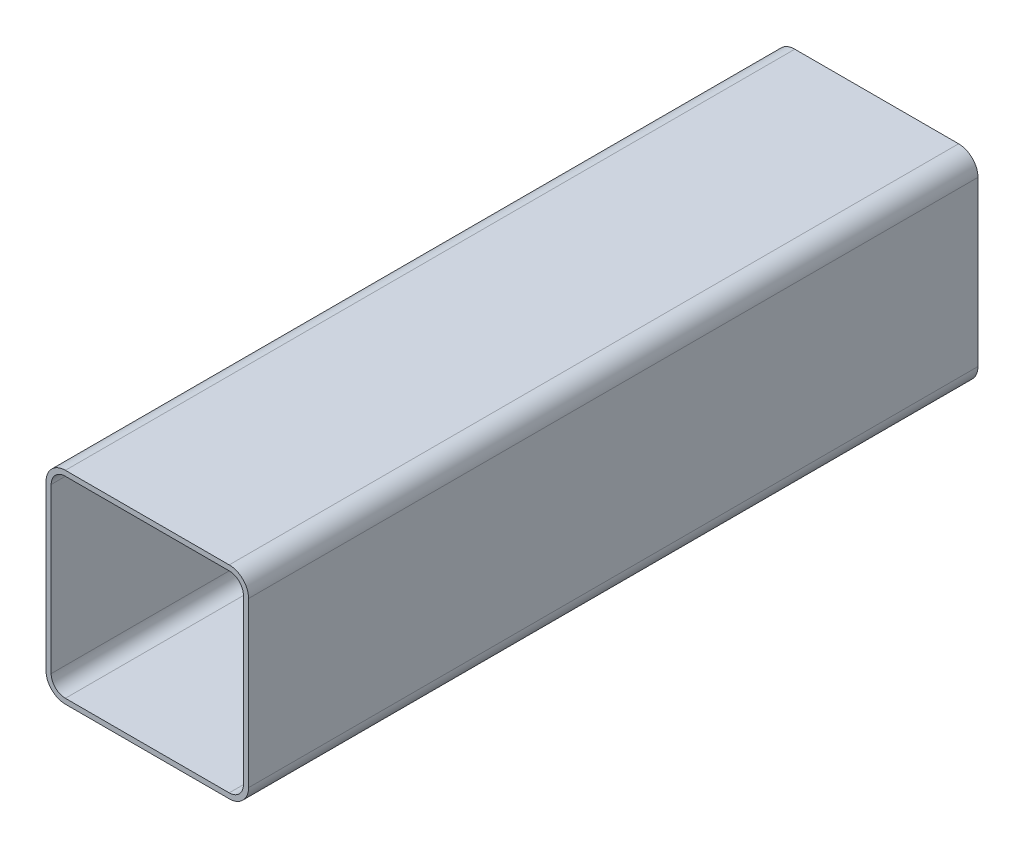
ISO-10303-21;
HEADER;
FILE_DESCRIPTION(('STEP AP214'),'2;1');
FILE_NAME('part.step','',(''),(''),'','','');
FILE_SCHEMA(('AUTOMOTIVE_DESIGN { 1 0 10303 214 1 1 1 1 }'));
ENDSEC;
DATA;
#1=APPLICATION_CONTEXT('core data for automotive mechanical design processes');
#2=APPLICATION_PROTOCOL_DEFINITION('international standard','automotive_design',2000,#1);
#3=PRODUCT_CONTEXT('',#1,'mechanical');
#4=PRODUCT('Part','Part','',(#3));
#5=PRODUCT_RELATED_PRODUCT_CATEGORY('part','',(#4));
#6=PRODUCT_DEFINITION_FORMATION('','',#4);
#7=PRODUCT_DEFINITION_CONTEXT('part definition',#1,'design');
#8=PRODUCT_DEFINITION('design','',#6,#7);
#9=PRODUCT_DEFINITION_SHAPE('','',#8);
#10=(LENGTH_UNIT() NAMED_UNIT(*) SI_UNIT(.MILLI.,.METRE.));
#11=(NAMED_UNIT(*) PLANE_ANGLE_UNIT() SI_UNIT($,.RADIAN.));
#12=(NAMED_UNIT(*) SI_UNIT($,.STERADIAN.) SOLID_ANGLE_UNIT());
#13=UNCERTAINTY_MEASURE_WITH_UNIT(LENGTH_MEASURE(1.E-05),#10,'distance_accuracy_value','');
#14=(GEOMETRIC_REPRESENTATION_CONTEXT(3) GLOBAL_UNCERTAINTY_ASSIGNED_CONTEXT((#13)) GLOBAL_UNIT_ASSIGNED_CONTEXT((#10,
#11,#12)) REPRESENTATION_CONTEXT('',''));
#15=CARTESIAN_POINT('',(0.,0.,0.));
#16=DIRECTION('',(0.,0.,1.));
#17=DIRECTION('',(1.,0.,0.));
#18=AXIS2_PLACEMENT_3D('',#15,#16,#17);
#19=CARTESIAN_POINT('',(-42.3291,-42.3291,-152.4));
#20=DIRECTION('',(0.,0.,1.));
#21=DIRECTION('',(1.,0.,0.));
#22=AXIS2_PLACEMENT_3D('',#19,#20,#21);
#23=PLANE('',#22);
#24=DIRECTION('',(0.,1.,0.));
#25=VECTOR('',#24,1.);
#26=CARTESIAN_POINT('',(-40.1701,0.,-152.4));
#27=LINE('',#26,#25);
#28=CARTESIAN_POINT('',(-40.1701,-34.2265000005341,-152.4));
#29=VERTEX_POINT('',#28);
#30=CARTESIAN_POINT('',(-40.1701,34.2264999999996,-152.4));
#31=VERTEX_POINT('',#30);
#32=EDGE_CURVE('E157',#29,#31,#27,.T.);
#33=ORIENTED_EDGE('',*,*,#32,.F.);
#34=CARTESIAN_POINT('',(-34.2265,-34.2265000000007,-152.4));
#35=DIRECTION('',(0.,0.,-1.));
#36=DIRECTION('',(0.,1.,0.));
#37=AXIS2_PLACEMENT_3D('',#34,#35,#36);
#38=CIRCLE('',#37,5.9436);
#39=CARTESIAN_POINT('',(-34.2264999988568,-40.1701,-152.4));
#40=VERTEX_POINT('',#39);
#41=EDGE_CURVE('E208',#40,#29,#38,.T.);
#42=ORIENTED_EDGE('',*,*,#41,.F.);
#43=DIRECTION('',(-1.,0.,0.));
#44=VECTOR('',#43,1.);
#45=CARTESIAN_POINT('',(0.,-40.1701,-152.4));
#46=LINE('',#45,#44);
#47=CARTESIAN_POINT('',(34.2265,-40.1701,-152.4));
#48=VERTEX_POINT('',#47);
#49=EDGE_CURVE('E153',#48,#40,#46,.T.);
#50=ORIENTED_EDGE('',*,*,#49,.F.);
#51=CARTESIAN_POINT('',(34.2265,-34.2265000000007,-152.4));
#52=DIRECTION('',(0.,0.,-1.));
#53=DIRECTION('',(0.,1.,0.));
#54=AXIS2_PLACEMENT_3D('',#51,#52,#53);
#55=CIRCLE('',#54,5.9436);
#56=CARTESIAN_POINT('',(40.1701,-34.2265000012194,-152.4));
#57=VERTEX_POINT('',#56);
#58=EDGE_CURVE('E212',#57,#48,#55,.T.);
#59=ORIENTED_EDGE('',*,*,#58,.F.);
#60=DIRECTION('',(0.,-1.,0.));
#61=VECTOR('',#60,1.);
#62=CARTESIAN_POINT('',(40.1701,0.,-152.4));
#63=LINE('',#62,#61);
#64=CARTESIAN_POINT('',(40.1701,34.2264999999996,-152.4));
#65=VERTEX_POINT('',#64);
#66=EDGE_CURVE('E162',#65,#57,#63,.T.);
#67=ORIENTED_EDGE('',*,*,#66,.F.);
#68=CARTESIAN_POINT('',(34.2265,34.2264999999993,-152.4));
#69=DIRECTION('',(0.,0.,-1.));
#70=DIRECTION('',(0.,1.,0.));
#71=AXIS2_PLACEMENT_3D('',#68,#69,#70);
#72=CIRCLE('',#71,5.9436);
#73=CARTESIAN_POINT('',(34.2265000006095,40.1701,-152.4));
#74=VERTEX_POINT('',#73);
#75=EDGE_CURVE('E215',#74,#65,#72,.T.);
#76=ORIENTED_EDGE('',*,*,#75,.F.);
#77=DIRECTION('',(1.,0.,0.));
#78=VECTOR('',#77,1.);
#79=CARTESIAN_POINT('',(0.,40.1701,-152.4));
#80=LINE('',#79,#78);
#81=CARTESIAN_POINT('',(-34.2265,40.1701,-152.4));
#82=VERTEX_POINT('',#81);
#83=EDGE_CURVE('E167',#82,#74,#80,.T.);
#84=ORIENTED_EDGE('',*,*,#83,.F.);
#85=CARTESIAN_POINT('',(-34.2265,34.2264999999993,-152.4));
#86=DIRECTION('',(0.,0.,-1.));
#87=DIRECTION('',(0.,1.,0.));
#88=AXIS2_PLACEMENT_3D('',#85,#86,#87);
#89=CIRCLE('',#88,5.9436);
#90=EDGE_CURVE('E160',#31,#82,#89,.T.);
#91=ORIENTED_EDGE('',*,*,#90,.F.);
#92=EDGE_LOOP('',(#33,#42,#50,#59,#67,#76,#84,#91));
#93=FACE_BOUND('',#92,.T.);
#94=DIRECTION('',(0.,-1.,0.));
#95=VECTOR('',#94,1.);
#96=CARTESIAN_POINT('',(42.3291,0.,-152.4));
#97=LINE('',#96,#95);
#98=CARTESIAN_POINT('',(42.3291,34.2264999999997,-152.4));
#99=VERTEX_POINT('',#98);
#100=CARTESIAN_POINT('',(42.3291,-34.2265000000003,-152.4));
#101=VERTEX_POINT('',#100);
#102=EDGE_CURVE('E161',#99,#101,#97,.T.);
#103=ORIENTED_EDGE('',*,*,#102,.T.);
#104=CARTESIAN_POINT('',(34.2265,-34.2265000000005,-152.4));
#105=DIRECTION('',(0.,0.,-1.));
#106=DIRECTION('',(0.,1.,0.));
#107=AXIS2_PLACEMENT_3D('',#104,#105,#106);
#108=CIRCLE('',#107,8.1026);
#109=CARTESIAN_POINT('',(34.2265000015585,-42.3291,-152.4));
#110=VERTEX_POINT('',#109);
#111=EDGE_CURVE('E220',#101,#110,#108,.T.);
#112=ORIENTED_EDGE('',*,*,#111,.T.);
#113=DIRECTION('',(-1.,0.,0.));
#114=VECTOR('',#113,1.);
#115=CARTESIAN_POINT('',(0.,-42.3291,-152.4));
#116=LINE('',#115,#114);
#117=CARTESIAN_POINT('',(-34.2265,-42.3291,-152.4));
#118=VERTEX_POINT('',#117);
#119=EDGE_CURVE('E173',#110,#118,#116,.T.);
#120=ORIENTED_EDGE('',*,*,#119,.T.);
#121=CARTESIAN_POINT('',(-34.2265,-34.2265000000005,-152.4));
#122=DIRECTION('',(0.,0.,-1.));
#123=DIRECTION('',(0.,1.,0.));
#124=AXIS2_PLACEMENT_3D('',#121,#122,#123);
#125=CIRCLE('',#124,8.10260000000001);
#126=CARTESIAN_POINT('',(-42.3291,-34.2265000007278,-152.4));
#127=VERTEX_POINT('',#126);
#128=EDGE_CURVE('E224',#118,#127,#125,.T.);
#129=ORIENTED_EDGE('',*,*,#128,.T.);
#130=DIRECTION('',(0.,1.,0.));
#131=VECTOR('',#130,1.);
#132=CARTESIAN_POINT('',(-42.3291,0.,-152.4));
#133=LINE('',#132,#131);
#134=CARTESIAN_POINT('',(-42.3291,34.2264999999997,-152.4));
#135=VERTEX_POINT('',#134);
#136=EDGE_CURVE('E178',#127,#135,#133,.T.);
#137=ORIENTED_EDGE('',*,*,#136,.T.);
#138=CARTESIAN_POINT('',(-34.2265,34.2264999999995,-152.4));
#139=DIRECTION('',(0.,0.,-1.));
#140=DIRECTION('',(0.,1.,0.));
#141=AXIS2_PLACEMENT_3D('',#138,#139,#140);
#142=CIRCLE('',#141,8.10260000000001);
#143=CARTESIAN_POINT('',(-34.2264999991691,42.3291,-152.4));
#144=VERTEX_POINT('',#143);
#145=EDGE_CURVE('E140',#135,#144,#142,.T.);
#146=ORIENTED_EDGE('',*,*,#145,.T.);
#147=DIRECTION('',(1.,0.,0.));
#148=VECTOR('',#147,1.);
#149=CARTESIAN_POINT('',(0.,42.3291,-152.4));
#150=LINE('',#149,#148);
#151=CARTESIAN_POINT('',(34.2265,42.3291,-152.4));
#152=VERTEX_POINT('',#151);
#153=EDGE_CURVE('E138',#144,#152,#150,.T.);
#154=ORIENTED_EDGE('',*,*,#153,.T.);
#155=CARTESIAN_POINT('',(34.2265,34.2264999999995,-152.4));
#156=DIRECTION('',(0.,0.,-1.));
#157=DIRECTION('',(0.,1.,0.));
#158=AXIS2_PLACEMENT_3D('',#155,#156,#157);
#159=CIRCLE('',#158,8.1026);
#160=EDGE_CURVE('E19',#152,#99,#159,.T.);
#161=ORIENTED_EDGE('',*,*,#160,.T.);
#162=EDGE_LOOP('',(#103,#112,#120,#129,#137,#146,#154,#161));
#163=FACE_BOUND('',#162,.T.);
#164=ADVANCED_FACE('F15',(#93,#163),#23,.F.);
#165=CARTESIAN_POINT('',(34.2265,34.2265,152.4));
#166=DIRECTION('',(0.,0.,-1.));
#167=DIRECTION('',(0.,1.,0.));
#168=AXIS2_PLACEMENT_3D('',#165,#166,#167);
#169=CYLINDRICAL_SURFACE('',#168,8.1026);
#170=DIRECTION('',(0.,0.,1.));
#171=VECTOR('',#170,1.);
#172=CARTESIAN_POINT('',(34.2265,42.3291,0.));
#173=LINE('',#172,#171);
#174=CARTESIAN_POINT('',(34.2265,42.3291,152.4));
#175=VERTEX_POINT('',#174);
#176=EDGE_CURVE('E130',#152,#175,#173,.T.);
#177=ORIENTED_EDGE('',*,*,#176,.T.);
#178=CARTESIAN_POINT('',(34.2265,34.2265,152.4));
#179=DIRECTION('',(0.,0.,-1.));
#180=DIRECTION('',(0.,1.,0.));
#181=AXIS2_PLACEMENT_3D('',#178,#179,#180);
#182=CIRCLE('',#181,8.1026);
#183=CARTESIAN_POINT('',(42.3291,34.2265,152.4));
#184=VERTEX_POINT('',#183);
#185=EDGE_CURVE('E206',#184,#175,#182,.F.);
#186=ORIENTED_EDGE('',*,*,#185,.F.);
#187=DIRECTION('',(0.,0.,-1.));
#188=VECTOR('',#187,1.);
#189=CARTESIAN_POINT('',(42.3291,34.2265,0.));
#190=LINE('',#189,#188);
#191=EDGE_CURVE('E133',#184,#99,#190,.T.);
#192=ORIENTED_EDGE('',*,*,#191,.T.);
#193=ORIENTED_EDGE('',*,*,#160,.F.);
#194=EDGE_LOOP('',(#177,#186,#192,#193));
#195=FACE_BOUND('',#194,.T.);
#196=ADVANCED_FACE('F128',(#195),#169,.T.);
#197=CARTESIAN_POINT('',(-34.2265,42.3291,152.4));
#198=DIRECTION('',(0.,-1.,0.));
#199=DIRECTION('',(0.,0.,-1.));
#200=AXIS2_PLACEMENT_3D('',#197,#198,#199);
#201=PLANE('',#200);
#202=DIRECTION('',(0.,0.,-1.));
#203=VECTOR('',#202,1.);
#204=CARTESIAN_POINT('',(-34.2264999983381,42.3291,0.));
#205=LINE('',#204,#203);
#206=CARTESIAN_POINT('',(-34.2264999991691,42.3291,152.4));
#207=VERTEX_POINT('',#206);
#208=EDGE_CURVE('E143',#144,#207,#205,.F.);
#209=ORIENTED_EDGE('',*,*,#208,.T.);
#210=DIRECTION('',(-1.,0.,0.));
#211=VECTOR('',#210,1.);
#212=CARTESIAN_POINT('',(0.,42.3291,152.4));
#213=LINE('',#212,#211);
#214=EDGE_CURVE('E147',#175,#207,#213,.T.);
#215=ORIENTED_EDGE('',*,*,#214,.F.);
#216=ORIENTED_EDGE('',*,*,#176,.F.);
#217=ORIENTED_EDGE('',*,*,#153,.F.);
#218=EDGE_LOOP('',(#209,#215,#216,#217));
#219=FACE_BOUND('',#218,.T.);
#220=ADVANCED_FACE('F145',(#219),#201,.F.);
#221=CARTESIAN_POINT('',(-34.2265,34.2265,152.4));
#222=DIRECTION('',(0.,0.,-1.));
#223=DIRECTION('',(0.,1.,0.));
#224=AXIS2_PLACEMENT_3D('',#221,#222,#223);
#225=CYLINDRICAL_SURFACE('',#224,8.10260000000001);
#226=DIRECTION('',(0.,0.,1.));
#227=VECTOR('',#226,1.);
#228=CARTESIAN_POINT('',(-42.3291,34.2265,0.));
#229=LINE('',#228,#227);
#230=CARTESIAN_POINT('',(-42.3291,34.2265,152.4));
#231=VERTEX_POINT('',#230);
#232=EDGE_CURVE('E180',#135,#231,#229,.T.);
#233=ORIENTED_EDGE('',*,*,#232,.T.);
#234=CARTESIAN_POINT('',(-34.2265,34.2265,152.4));
#235=DIRECTION('',(0.,0.,-1.));
#236=DIRECTION('',(0.,1.,0.));
#237=AXIS2_PLACEMENT_3D('',#234,#235,#236);
#238=CIRCLE('',#237,8.10260000000001);
#239=EDGE_CURVE('E203',#207,#231,#238,.F.);
#240=ORIENTED_EDGE('',*,*,#239,.F.);
#241=ORIENTED_EDGE('',*,*,#208,.F.);
#242=ORIENTED_EDGE('',*,*,#145,.F.);
#243=EDGE_LOOP('',(#233,#240,#241,#242));
#244=FACE_BOUND('',#243,.T.);
#245=ADVANCED_FACE('F228',(#244),#225,.T.);
#246=CARTESIAN_POINT('',(-42.3291,-34.2265,152.4));
#247=DIRECTION('',(1.,0.,0.));
#248=DIRECTION('',(0.,0.,-1.));
#249=AXIS2_PLACEMENT_3D('',#246,#247,#248);
#250=PLANE('',#249);
#251=DIRECTION('',(0.,0.,-1.));
#252=VECTOR('',#251,1.);
#253=CARTESIAN_POINT('',(-42.3291,-34.2265000014551,0.));
#254=LINE('',#253,#252);
#255=CARTESIAN_POINT('',(-42.3291,-34.2265000007276,152.4));
#256=VERTEX_POINT('',#255);
#257=EDGE_CURVE('E179',#127,#256,#254,.F.);
#258=ORIENTED_EDGE('',*,*,#257,.T.);
#259=DIRECTION('',(0.,-1.,0.));
#260=VECTOR('',#259,1.);
#261=CARTESIAN_POINT('',(-42.3291,0.,152.4));
#262=LINE('',#261,#260);
#263=EDGE_CURVE('E202',#231,#256,#262,.T.);
#264=ORIENTED_EDGE('',*,*,#263,.F.);
#265=ORIENTED_EDGE('',*,*,#232,.F.);
#266=ORIENTED_EDGE('',*,*,#136,.F.);
#267=EDGE_LOOP('',(#258,#264,#265,#266));
#268=FACE_BOUND('',#267,.T.);
#269=ADVANCED_FACE('F260',(#268),#250,.F.);
#270=CARTESIAN_POINT('',(-34.2265,-34.2265,152.4));
#271=DIRECTION('',(0.,0.,-1.));
#272=DIRECTION('',(0.,1.,0.));
#273=AXIS2_PLACEMENT_3D('',#270,#271,#272);
#274=CYLINDRICAL_SURFACE('',#273,8.10260000000001);
#275=DIRECTION('',(0.,0.,1.));
#276=VECTOR('',#275,1.);
#277=CARTESIAN_POINT('',(-34.2265,-42.3291,0.));
#278=LINE('',#277,#276);
#279=CARTESIAN_POINT('',(-34.2265,-42.3291,152.4));
#280=VERTEX_POINT('',#279);
#281=EDGE_CURVE('E177',#118,#280,#278,.T.);
#282=ORIENTED_EDGE('',*,*,#281,.T.);
#283=CARTESIAN_POINT('',(-34.2265,-34.2265,152.4));
#284=DIRECTION('',(0.,0.,-1.));
#285=DIRECTION('',(0.,1.,0.));
#286=AXIS2_PLACEMENT_3D('',#283,#284,#285);
#287=CIRCLE('',#286,8.10260000000001);
#288=EDGE_CURVE('E199',#256,#280,#287,.F.);
#289=ORIENTED_EDGE('',*,*,#288,.F.);
#290=ORIENTED_EDGE('',*,*,#257,.F.);
#291=ORIENTED_EDGE('',*,*,#128,.F.);
#292=EDGE_LOOP('',(#282,#289,#290,#291));
#293=FACE_BOUND('',#292,.T.);
#294=ADVANCED_FACE('F262',(#293),#274,.T.);
#295=CARTESIAN_POINT('',(-34.2265,-42.3291,-152.4));
#296=DIRECTION('',(0.,1.,0.));
#297=DIRECTION('',(0.,0.,1.));
#298=AXIS2_PLACEMENT_3D('',#295,#296,#297);
#299=PLANE('',#298);
#300=DIRECTION('',(0.,0.,-1.));
#301=VECTOR('',#300,1.);
#302=CARTESIAN_POINT('',(34.226500003117,-42.3291,0.));
#303=LINE('',#302,#301);
#304=CARTESIAN_POINT('',(34.2265000015585,-42.3291,152.4));
#305=VERTEX_POINT('',#304);
#306=EDGE_CURVE('E176',#110,#305,#303,.F.);
#307=ORIENTED_EDGE('',*,*,#306,.T.);
#308=DIRECTION('',(1.,0.,0.));
#309=VECTOR('',#308,1.);
#310=CARTESIAN_POINT('',(0.,-42.3291,152.4));
#311=LINE('',#310,#309);
#312=EDGE_CURVE('E198',#280,#305,#311,.T.);
#313=ORIENTED_EDGE('',*,*,#312,.F.);
#314=ORIENTED_EDGE('',*,*,#281,.F.);
#315=ORIENTED_EDGE('',*,*,#119,.F.);
#316=EDGE_LOOP('',(#307,#313,#314,#315));
#317=FACE_BOUND('',#316,.T.);
#318=ADVANCED_FACE('F318',(#317),#299,.F.);
#319=CARTESIAN_POINT('',(34.2265,-34.2265,152.4));
#320=DIRECTION('',(0.,0.,-1.));
#321=DIRECTION('',(0.,1.,0.));
#322=AXIS2_PLACEMENT_3D('',#319,#320,#321);
#323=CYLINDRICAL_SURFACE('',#322,8.1026);
#324=DIRECTION('',(0.,0.,1.));
#325=VECTOR('',#324,1.);
#326=CARTESIAN_POINT('',(42.3291,-34.2265,0.));
#327=LINE('',#326,#325);
#328=CARTESIAN_POINT('',(42.3291,-34.2265,152.4));
#329=VERTEX_POINT('',#328);
#330=EDGE_CURVE('E223',#101,#329,#327,.T.);
#331=ORIENTED_EDGE('',*,*,#330,.T.);
#332=CARTESIAN_POINT('',(34.2265,-34.2265,152.4));
#333=DIRECTION('',(0.,0.,-1.));
#334=DIRECTION('',(0.,1.,0.));
#335=AXIS2_PLACEMENT_3D('',#332,#333,#334);
#336=CIRCLE('',#335,8.1026);
#337=EDGE_CURVE('E194',#305,#329,#336,.F.);
#338=ORIENTED_EDGE('',*,*,#337,.F.);
#339=ORIENTED_EDGE('',*,*,#306,.F.);
#340=ORIENTED_EDGE('',*,*,#111,.F.);
#341=EDGE_LOOP('',(#331,#338,#339,#340));
#342=FACE_BOUND('',#341,.T.);
#343=ADVANCED_FACE('F314',(#342),#323,.T.);
#344=CARTESIAN_POINT('',(42.3291,-34.2265,-152.4));
#345=DIRECTION('',(-1.,0.,0.));
#346=DIRECTION('',(0.,0.,1.));
#347=AXIS2_PLACEMENT_3D('',#344,#345,#346);
#348=PLANE('',#347);
#349=ORIENTED_EDGE('',*,*,#191,.F.);
#350=DIRECTION('',(0.,1.,0.));
#351=VECTOR('',#350,1.);
#352=CARTESIAN_POINT('',(42.3291,0.,152.4));
#353=LINE('',#352,#351);
#354=EDGE_CURVE('E197',#329,#184,#353,.T.);
#355=ORIENTED_EDGE('',*,*,#354,.F.);
#356=ORIENTED_EDGE('',*,*,#330,.F.);
#357=ORIENTED_EDGE('',*,*,#102,.F.);
#358=EDGE_LOOP('',(#349,#355,#356,#357));
#359=FACE_BOUND('',#358,.T.);
#360=ADVANCED_FACE('F317',(#359),#348,.F.);
#361=CARTESIAN_POINT('',(-40.1701,-34.2265,152.4));
#362=DIRECTION('',(1.,0.,0.));
#363=DIRECTION('',(0.,0.,-1.));
#364=AXIS2_PLACEMENT_3D('',#361,#362,#363);
#365=PLANE('',#364);
#366=DIRECTION('',(0.,1.,0.));
#367=VECTOR('',#366,1.);
#368=CARTESIAN_POINT('',(-40.17010002159,0.,152.4));
#369=LINE('',#368,#367);
#370=CARTESIAN_POINT('',(-40.170100010795,-34.2265000005337,152.4));
#371=VERTEX_POINT('',#370);
#372=CARTESIAN_POINT('',(-40.170100010795,34.2265,152.4));
#373=VERTEX_POINT('',#372);
#374=EDGE_CURVE('E193',#371,#373,#369,.T.);
#375=ORIENTED_EDGE('',*,*,#374,.F.);
#376=DIRECTION('',(0.,0.,-1.));
#377=VECTOR('',#376,1.);
#378=CARTESIAN_POINT('',(-40.1701,-34.2265000010674,0.));
#379=LINE('',#378,#377);
#380=EDGE_CURVE('E211',#29,#371,#379,.F.);
#381=ORIENTED_EDGE('',*,*,#380,.F.);
#382=ORIENTED_EDGE('',*,*,#32,.T.);
#383=DIRECTION('',(0.,0.,1.));
#384=VECTOR('',#383,1.);
#385=CARTESIAN_POINT('',(-40.1701,34.2265,0.));
#386=LINE('',#385,#384);
#387=EDGE_CURVE('E171',#373,#31,#386,.F.);
#388=ORIENTED_EDGE('',*,*,#387,.F.);
#389=EDGE_LOOP('',(#375,#381,#382,#388));
#390=FACE_BOUND('',#389,.T.);
#391=ADVANCED_FACE('F297',(#390),#365,.T.);
#392=CARTESIAN_POINT('',(-34.2265,34.2265,152.4));
#393=DIRECTION('',(0.,0.,-1.));
#394=DIRECTION('',(0.,1.,0.));
#395=AXIS2_PLACEMENT_3D('',#392,#393,#394);
#396=CYLINDRICAL_SURFACE('',#395,5.9436);
#397=CARTESIAN_POINT('',(-34.2265,34.2265,152.4));
#398=DIRECTION('',(0.,0.,-1.));
#399=DIRECTION('',(0.,1.,0.));
#400=AXIS2_PLACEMENT_3D('',#397,#398,#399);
#401=CIRCLE('',#400,5.9436);
#402=CARTESIAN_POINT('',(-34.2265,40.170100010795,152.4));
#403=VERTEX_POINT('',#402);
#404=EDGE_CURVE('E190',#373,#403,#401,.T.);
#405=ORIENTED_EDGE('',*,*,#404,.F.);
#406=ORIENTED_EDGE('',*,*,#387,.T.);
#407=ORIENTED_EDGE('',*,*,#90,.T.);
#408=DIRECTION('',(0.,0.,-1.));
#409=VECTOR('',#408,1.);
#410=CARTESIAN_POINT('',(-34.2265,40.1701,0.));
#411=LINE('',#410,#409);
#412=EDGE_CURVE('E170',#403,#82,#411,.T.);
#413=ORIENTED_EDGE('',*,*,#412,.F.);
#414=EDGE_LOOP('',(#405,#406,#407,#413));
#415=FACE_BOUND('',#414,.T.);
#416=ADVANCED_FACE('F294',(#415),#396,.F.);
#417=CARTESIAN_POINT('',(-34.2265,40.1701,152.4));
#418=DIRECTION('',(0.,-1.,0.));
#419=DIRECTION('',(0.,0.,-1.));
#420=AXIS2_PLACEMENT_3D('',#417,#418,#419);
#421=PLANE('',#420);
#422=DIRECTION('',(1.,0.,0.));
#423=VECTOR('',#422,1.);
#424=CARTESIAN_POINT('',(0.,40.17010002159,152.4));
#425=LINE('',#424,#423);
#426=CARTESIAN_POINT('',(34.2265000006095,40.170100010795,152.4));
#427=VERTEX_POINT('',#426);
#428=EDGE_CURVE('E189',#403,#427,#425,.T.);
#429=ORIENTED_EDGE('',*,*,#428,.F.);
#430=ORIENTED_EDGE('',*,*,#412,.T.);
#431=ORIENTED_EDGE('',*,*,#83,.T.);
#432=DIRECTION('',(0.,0.,1.));
#433=VECTOR('',#432,1.);
#434=CARTESIAN_POINT('',(34.2265000012191,40.1701,0.));
#435=LINE('',#434,#433);
#436=EDGE_CURVE('E166',#427,#74,#435,.F.);
#437=ORIENTED_EDGE('',*,*,#436,.F.);
#438=EDGE_LOOP('',(#429,#430,#431,#437));
#439=FACE_BOUND('',#438,.T.);
#440=ADVANCED_FACE('F291',(#439),#421,.T.);
#441=CARTESIAN_POINT('',(34.2265,34.2265,152.4));
#442=DIRECTION('',(0.,0.,-1.));
#443=DIRECTION('',(0.,1.,0.));
#444=AXIS2_PLACEMENT_3D('',#441,#442,#443);
#445=CYLINDRICAL_SURFACE('',#444,5.9436);
#446=CARTESIAN_POINT('',(34.2265,34.2265,152.4));
#447=DIRECTION('',(0.,0.,-1.));
#448=DIRECTION('',(0.,1.,0.));
#449=AXIS2_PLACEMENT_3D('',#446,#447,#448);
#450=CIRCLE('',#449,5.9436);
#451=CARTESIAN_POINT('',(40.170100010795,34.2265,152.4));
#452=VERTEX_POINT('',#451);
#453=EDGE_CURVE('E186',#427,#452,#450,.T.);
#454=ORIENTED_EDGE('',*,*,#453,.F.);
#455=ORIENTED_EDGE('',*,*,#436,.T.);
#456=ORIENTED_EDGE('',*,*,#75,.T.);
#457=DIRECTION('',(0.,0.,-1.));
#458=VECTOR('',#457,1.);
#459=CARTESIAN_POINT('',(40.1701,34.2265,0.));
#460=LINE('',#459,#458);
#461=EDGE_CURVE('E165',#452,#65,#460,.T.);
#462=ORIENTED_EDGE('',*,*,#461,.F.);
#463=EDGE_LOOP('',(#454,#455,#456,#462));
#464=FACE_BOUND('',#463,.T.);
#465=ADVANCED_FACE('F288',(#464),#445,.F.);
#466=CARTESIAN_POINT('',(40.1701,-34.2265,-152.4));
#467=DIRECTION('',(-1.,0.,0.));
#468=DIRECTION('',(0.,0.,1.));
#469=AXIS2_PLACEMENT_3D('',#466,#467,#468);
#470=PLANE('',#469);
#471=DIRECTION('',(0.,-1.,0.));
#472=VECTOR('',#471,1.);
#473=CARTESIAN_POINT('',(40.17010002159,0.,152.4));
#474=LINE('',#473,#472);
#475=CARTESIAN_POINT('',(40.170100010795,-34.2265000012191,152.4));
#476=VERTEX_POINT('',#475);
#477=EDGE_CURVE('E185',#452,#476,#474,.T.);
#478=ORIENTED_EDGE('',*,*,#477,.F.);
#479=ORIENTED_EDGE('',*,*,#461,.T.);
#480=ORIENTED_EDGE('',*,*,#66,.T.);
#481=DIRECTION('',(0.,0.,1.));
#482=VECTOR('',#481,1.);
#483=CARTESIAN_POINT('',(40.1701,-34.2265000024381,0.));
#484=LINE('',#483,#482);
#485=EDGE_CURVE('E156',#476,#57,#484,.F.);
#486=ORIENTED_EDGE('',*,*,#485,.F.);
#487=EDGE_LOOP('',(#478,#479,#480,#486));
#488=FACE_BOUND('',#487,.T.);
#489=ADVANCED_FACE('F285',(#488),#470,.T.);
#490=CARTESIAN_POINT('',(34.2265,-34.2265,152.4));
#491=DIRECTION('',(0.,0.,-1.));
#492=DIRECTION('',(0.,1.,0.));
#493=AXIS2_PLACEMENT_3D('',#490,#491,#492);
#494=CYLINDRICAL_SURFACE('',#493,5.9436);
#495=CARTESIAN_POINT('',(34.2265,-34.2265,152.4));
#496=DIRECTION('',(0.,0.,-1.));
#497=DIRECTION('',(0.,1.,0.));
#498=AXIS2_PLACEMENT_3D('',#495,#496,#497);
#499=CIRCLE('',#498,5.9436);
#500=CARTESIAN_POINT('',(34.2265,-40.170100010795,152.4));
#501=VERTEX_POINT('',#500);
#502=EDGE_CURVE('E182',#476,#501,#499,.T.);
#503=ORIENTED_EDGE('',*,*,#502,.F.);
#504=ORIENTED_EDGE('',*,*,#485,.T.);
#505=ORIENTED_EDGE('',*,*,#58,.T.);
#506=DIRECTION('',(0.,0.,-1.));
#507=VECTOR('',#506,1.);
#508=CARTESIAN_POINT('',(34.2265,-40.1701,0.));
#509=LINE('',#508,#507);
#510=EDGE_CURVE('E155',#501,#48,#509,.T.);
#511=ORIENTED_EDGE('',*,*,#510,.F.);
#512=EDGE_LOOP('',(#503,#504,#505,#511));
#513=FACE_BOUND('',#512,.T.);
#514=ADVANCED_FACE('F281',(#513),#494,.F.);
#515=CARTESIAN_POINT('',(-34.2265,-40.1701,-152.4));
#516=DIRECTION('',(0.,1.,0.));
#517=DIRECTION('',(0.,0.,1.));
#518=AXIS2_PLACEMENT_3D('',#515,#516,#517);
#519=PLANE('',#518);
#520=DIRECTION('',(-1.,0.,0.));
#521=VECTOR('',#520,1.);
#522=CARTESIAN_POINT('',(0.,-40.17010002159,152.4));
#523=LINE('',#522,#521);
#524=CARTESIAN_POINT('',(-34.2264999988568,-40.170100010795,152.4));
#525=VERTEX_POINT('',#524);
#526=EDGE_CURVE('E25',#501,#525,#523,.T.);
#527=ORIENTED_EDGE('',*,*,#526,.F.);
#528=ORIENTED_EDGE('',*,*,#510,.T.);
#529=ORIENTED_EDGE('',*,*,#49,.T.);
#530=DIRECTION('',(0.,0.,1.));
#531=VECTOR('',#530,1.);
#532=CARTESIAN_POINT('',(-34.2264999977136,-40.1701,0.));
#533=LINE('',#532,#531);
#534=EDGE_CURVE('E34',#525,#40,#533,.F.);
#535=ORIENTED_EDGE('',*,*,#534,.F.);
#536=EDGE_LOOP('',(#527,#528,#529,#535));
#537=FACE_BOUND('',#536,.T.);
#538=ADVANCED_FACE('F279',(#537),#519,.T.);
#539=CARTESIAN_POINT('',(-34.2265,-34.2265,152.4));
#540=DIRECTION('',(0.,0.,-1.));
#541=DIRECTION('',(0.,1.,0.));
#542=AXIS2_PLACEMENT_3D('',#539,#540,#541);
#543=CYLINDRICAL_SURFACE('',#542,5.9436);
#544=CARTESIAN_POINT('',(-34.2265,-34.2265,152.4));
#545=DIRECTION('',(0.,0.,-1.));
#546=DIRECTION('',(0.,1.,0.));
#547=AXIS2_PLACEMENT_3D('',#544,#545,#546);
#548=CIRCLE('',#547,5.9436);
#549=EDGE_CURVE('E9',#525,#371,#548,.T.);
#550=ORIENTED_EDGE('',*,*,#549,.F.);
#551=ORIENTED_EDGE('',*,*,#534,.T.);
#552=ORIENTED_EDGE('',*,*,#41,.T.);
#553=ORIENTED_EDGE('',*,*,#380,.T.);
#554=EDGE_LOOP('',(#550,#551,#552,#553));
#555=FACE_BOUND('',#554,.T.);
#556=ADVANCED_FACE('F299',(#555),#543,.F.);
#557=CARTESIAN_POINT('',(-42.3291,-42.3291,152.4));
#558=DIRECTION('',(0.,0.,1.));
#559=DIRECTION('',(1.,0.,0.));
#560=AXIS2_PLACEMENT_3D('',#557,#558,#559);
#561=PLANE('',#560);
#562=ORIENTED_EDGE('',*,*,#526,.T.);
#563=ORIENTED_EDGE('',*,*,#549,.T.);
#564=ORIENTED_EDGE('',*,*,#374,.T.);
#565=ORIENTED_EDGE('',*,*,#404,.T.);
#566=ORIENTED_EDGE('',*,*,#428,.T.);
#567=ORIENTED_EDGE('',*,*,#453,.T.);
#568=ORIENTED_EDGE('',*,*,#477,.T.);
#569=ORIENTED_EDGE('',*,*,#502,.T.);
#570=EDGE_LOOP('',(#562,#563,#564,#565,#566,#567,#568,#569));
#571=FACE_BOUND('',#570,.T.);
#572=ORIENTED_EDGE('',*,*,#337,.T.);
#573=ORIENTED_EDGE('',*,*,#354,.T.);
#574=ORIENTED_EDGE('',*,*,#185,.T.);
#575=ORIENTED_EDGE('',*,*,#214,.T.);
#576=ORIENTED_EDGE('',*,*,#239,.T.);
#577=ORIENTED_EDGE('',*,*,#263,.T.);
#578=ORIENTED_EDGE('',*,*,#288,.T.);
#579=ORIENTED_EDGE('',*,*,#312,.T.);
#580=EDGE_LOOP('',(#572,#573,#574,#575,#576,#577,#578,#579));
#581=FACE_BOUND('',#580,.T.);
#582=ADVANCED_FACE('F17',(#571,#581),#561,.T.);
#583=CLOSED_SHELL('',(#164,#196,#220,#245,#269,#294,#318,#343,#360,#391,#416,#440,#465,#489,
#514,#538,#556,#582));
#584=MANIFOLD_SOLID_BREP('B1',#583);
#585=ADVANCED_BREP_SHAPE_REPRESENTATION('',(#18,#584),#14);
#586=SHAPE_DEFINITION_REPRESENTATION(#9,#585);
ENDSEC;
END-ISO-10303-21;
